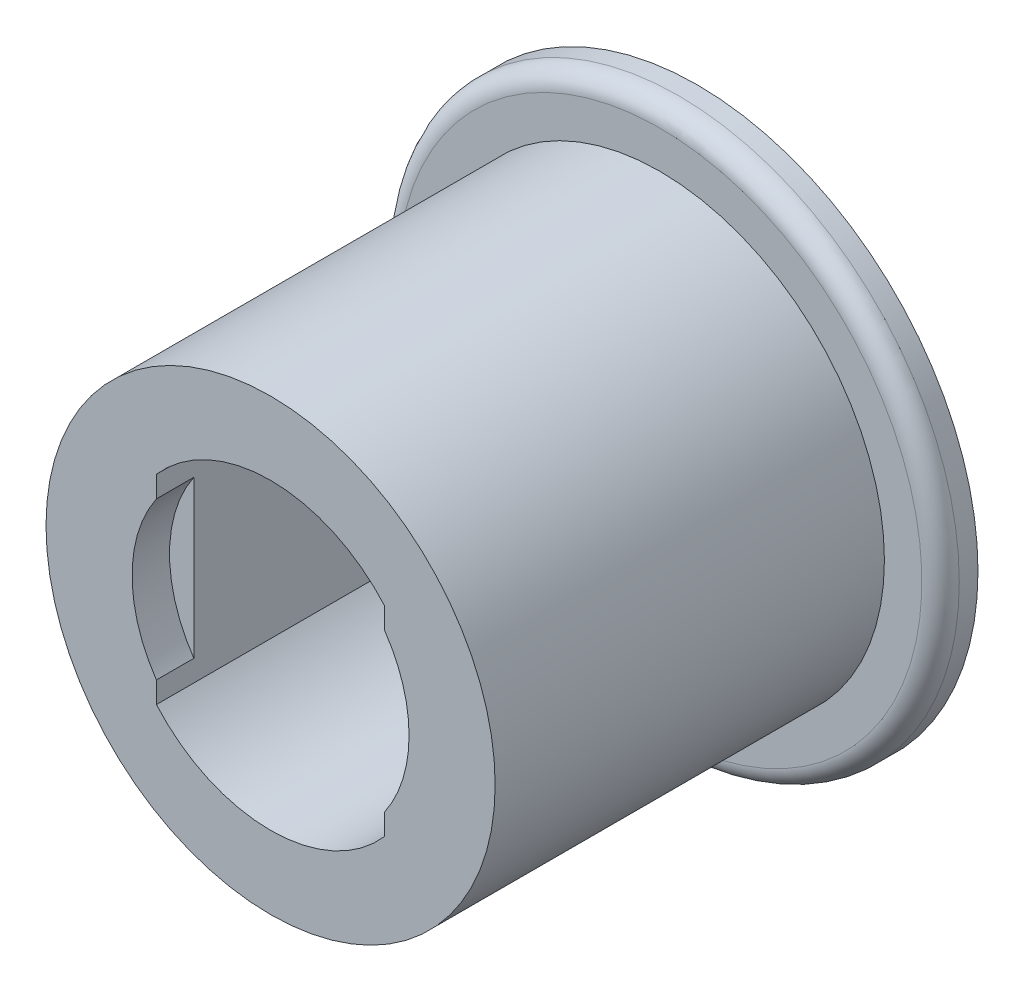
ISO-10303-21;
HEADER;
FILE_DESCRIPTION(('STEP AP214'),'2;1');
FILE_NAME('part.step','',(''),(''),'','','');
FILE_SCHEMA(('AUTOMOTIVE_DESIGN { 1 0 10303 214 1 1 1 1 }'));
ENDSEC;
DATA;
#1=APPLICATION_CONTEXT('core data for automotive mechanical design processes');
#2=APPLICATION_PROTOCOL_DEFINITION('international standard','automotive_design',2000,#1);
#3=PRODUCT_CONTEXT('',#1,'mechanical');
#4=PRODUCT('Part','Part','',(#3));
#5=PRODUCT_RELATED_PRODUCT_CATEGORY('part','',(#4));
#6=PRODUCT_DEFINITION_FORMATION('','',#4);
#7=PRODUCT_DEFINITION_CONTEXT('part definition',#1,'design');
#8=PRODUCT_DEFINITION('design','',#6,#7);
#9=PRODUCT_DEFINITION_SHAPE('','',#8);
#10=(LENGTH_UNIT() NAMED_UNIT(*) SI_UNIT(.MILLI.,.METRE.));
#11=(NAMED_UNIT(*) PLANE_ANGLE_UNIT() SI_UNIT($,.RADIAN.));
#12=(NAMED_UNIT(*) SI_UNIT($,.STERADIAN.) SOLID_ANGLE_UNIT());
#13=UNCERTAINTY_MEASURE_WITH_UNIT(LENGTH_MEASURE(1.E-05),#10,'distance_accuracy_value','');
#14=(GEOMETRIC_REPRESENTATION_CONTEXT(3) GLOBAL_UNCERTAINTY_ASSIGNED_CONTEXT((#13)) GLOBAL_UNIT_ASSIGNED_CONTEXT((#10,
#11,#12)) REPRESENTATION_CONTEXT('',''));
#15=CARTESIAN_POINT('',(0.,0.,0.));
#16=DIRECTION('',(0.,0.,1.));
#17=DIRECTION('',(1.,0.,0.));
#18=AXIS2_PLACEMENT_3D('',#15,#16,#17);
#19=CARTESIAN_POINT('',(0.,0.,0.5));
#20=DIRECTION('',(0.,0.,-1.));
#21=DIRECTION('',(-1.,0.,0.));
#22=AXIS2_PLACEMENT_3D('',#19,#20,#21);
#23=CYLINDRICAL_SURFACE('',#22,1.85);
#24=CARTESIAN_POINT('',(0.,0.,0.));
#25=DIRECTION('',(0.,0.,-1.));
#26=DIRECTION('',(-1.,0.,0.));
#27=AXIS2_PLACEMENT_3D('',#24,#25,#26);
#28=CIRCLE('',#27,1.85);
#29=CARTESIAN_POINT('',(-1.525,-1.04731800328267,0.));
#30=VERTEX_POINT('',#29);
#31=CARTESIAN_POINT('',(-1.525,1.04731800328267,0.));
#32=VERTEX_POINT('',#31);
#33=EDGE_CURVE('E181',#30,#32,#28,.T.);
#34=ORIENTED_EDGE('',*,*,#33,.T.);
#35=DIRECTION('',(0.,0.,-1.));
#36=VECTOR('',#35,1.);
#37=CARTESIAN_POINT('',(-1.525,1.04731800328267,0.5));
#38=LINE('',#37,#36);
#39=CARTESIAN_POINT('',(-1.525,1.04731800328267,0.5));
#40=VERTEX_POINT('',#39);
#41=EDGE_CURVE('E178',#32,#40,#38,.F.);
#42=ORIENTED_EDGE('',*,*,#41,.T.);
#43=CARTESIAN_POINT('',(0.,0.,0.5));
#44=DIRECTION('',(0.,0.,-1.));
#45=DIRECTION('',(-1.,0.,0.));
#46=AXIS2_PLACEMENT_3D('',#43,#44,#45);
#47=CIRCLE('',#46,1.85);
#48=CARTESIAN_POINT('',(-1.525,-1.04731800328267,0.5));
#49=VERTEX_POINT('',#48);
#50=EDGE_CURVE('E186',#49,#40,#47,.T.);
#51=ORIENTED_EDGE('',*,*,#50,.F.);
#52=DIRECTION('',(0.,0.,-1.));
#53=VECTOR('',#52,1.);
#54=CARTESIAN_POINT('',(-1.525,-1.04731800328267,0.5));
#55=LINE('',#54,#53);
#56=EDGE_CURVE('E175',#49,#30,#55,.T.);
#57=ORIENTED_EDGE('',*,*,#56,.T.);
#58=EDGE_LOOP('',(#34,#42,#51,#57));
#59=FACE_BOUND('',#58,.T.);
#60=ADVANCED_FACE('F42',(#59),#23,.F.);
#61=CARTESIAN_POINT('',(0.,0.,0.));
#62=DIRECTION('',(0.,0.,1.));
#63=DIRECTION('',(1.,0.,0.));
#64=AXIS2_PLACEMENT_3D('',#61,#62,#63);
#65=PLANE('',#64);
#66=DIRECTION('',(0.,-1.,0.));
#67=VECTOR('',#66,1.);
#68=CARTESIAN_POINT('',(-1.525,0.,0.));
#69=LINE('',#68,#67);
#70=EDGE_CURVE('E11',#32,#30,#69,.T.);
#71=ORIENTED_EDGE('',*,*,#70,.F.);
#72=ORIENTED_EDGE('',*,*,#33,.F.);
#73=EDGE_LOOP('',(#71,#72));
#74=FACE_BOUND('',#73,.T.);
#75=ADVANCED_FACE('F214',(#74),#65,.T.);
#76=CARTESIAN_POINT('',(0.,0.,0.5));
#77=DIRECTION('',(0.,0.,1.));
#78=DIRECTION('',(1.,0.,0.));
#79=AXIS2_PLACEMENT_3D('',#76,#77,#78);
#80=PLANE('',#79);
#81=DIRECTION('',(0.,1.,0.));
#82=VECTOR('',#81,1.);
#83=CARTESIAN_POINT('',(-1.525,-1.33229125944742,0.5));
#84=LINE('',#83,#82);
#85=CARTESIAN_POINT('',(-1.525,-1.33229125944742,0.5));
#86=VERTEX_POINT('',#85);
#87=EDGE_CURVE('E137',#86,#49,#84,.T.);
#88=ORIENTED_EDGE('',*,*,#87,.T.);
#89=ORIENTED_EDGE('',*,*,#50,.T.);
#90=CARTESIAN_POINT('',(-1.525,1.33229125944742,0.5));
#91=VERTEX_POINT('',#90);
#92=EDGE_CURVE('E152',#40,#91,#84,.T.);
#93=ORIENTED_EDGE('',*,*,#92,.T.);
#94=CARTESIAN_POINT('',(0.,0.,0.5));
#95=DIRECTION('',(0.,0.,-1.));
#96=DIRECTION('',(-1.,0.,0.));
#97=AXIS2_PLACEMENT_3D('',#94,#95,#96);
#98=CIRCLE('',#97,2.025);
#99=CARTESIAN_POINT('',(1.525,1.33229125944742,0.5));
#100=VERTEX_POINT('',#99);
#101=EDGE_CURVE('E132',#91,#100,#98,.T.);
#102=ORIENTED_EDGE('',*,*,#101,.T.);
#103=DIRECTION('',(0.,-1.,0.));
#104=VECTOR('',#103,1.);
#105=CARTESIAN_POINT('',(1.525,1.33229125944742,0.5));
#106=LINE('',#105,#104);
#107=CARTESIAN_POINT('',(1.525,1.04731800328267,0.5));
#108=VERTEX_POINT('',#107);
#109=EDGE_CURVE('E140',#100,#108,#106,.T.);
#110=ORIENTED_EDGE('',*,*,#109,.T.);
#111=CARTESIAN_POINT('',(1.85,0.,0.5));
#112=VERTEX_POINT('',#111);
#113=EDGE_CURVE('E187',#108,#112,#47,.T.);
#114=ORIENTED_EDGE('',*,*,#113,.T.);
#115=CARTESIAN_POINT('',(1.525,-1.04731800328267,0.5));
#116=VERTEX_POINT('',#115);
#117=EDGE_CURVE('E182',#112,#116,#47,.T.);
#118=ORIENTED_EDGE('',*,*,#117,.T.);
#119=CARTESIAN_POINT('',(1.525,-1.33229125944742,0.5));
#120=VERTEX_POINT('',#119);
#121=EDGE_CURVE('E147',#116,#120,#106,.T.);
#122=ORIENTED_EDGE('',*,*,#121,.T.);
#123=CARTESIAN_POINT('',(0.,0.,0.5));
#124=DIRECTION('',(0.,0.,-1.));
#125=DIRECTION('',(-1.,0.,0.));
#126=AXIS2_PLACEMENT_3D('',#123,#124,#125);
#127=CIRCLE('',#126,2.025);
#128=EDGE_CURVE('E146',#120,#86,#127,.T.);
#129=ORIENTED_EDGE('',*,*,#128,.T.);
#130=EDGE_LOOP('',(#88,#89,#93,#102,#110,#114,#118,#122,#129));
#131=FACE_BOUND('',#130,.T.);
#132=CARTESIAN_POINT('',(0.,0.,0.5));
#133=DIRECTION('',(0.,0.,1.));
#134=DIRECTION('',(-1.,0.,0.));
#135=AXIS2_PLACEMENT_3D('',#132,#133,#134);
#136=CIRCLE('',#135,3.);
#137=CARTESIAN_POINT('',(3.,0.,0.5));
#138=VERTEX_POINT('',#137);
#139=EDGE_CURVE('E185',#138,#138,#136,.T.);
#140=ORIENTED_EDGE('',*,*,#139,.T.);
#141=EDGE_LOOP('',(#140));
#142=FACE_BOUND('',#141,.T.);
#143=ADVANCED_FACE('F44',(#131,#142),#80,.T.);
#144=CARTESIAN_POINT('',(0.,0.,0.));
#145=DIRECTION('',(0.,0.,1.));
#146=DIRECTION('',(-1.,0.,0.));
#147=AXIS2_PLACEMENT_3D('',#144,#145,#146);
#148=CYLINDRICAL_SURFACE('',#147,3.);
#149=ORIENTED_EDGE('',*,*,#139,.F.);
#150=EDGE_LOOP('',(#149));
#151=FACE_BOUND('',#150,.T.);
#152=CARTESIAN_POINT('',(0.,0.,-4.7));
#153=DIRECTION('',(0.,0.,-1.));
#154=DIRECTION('',(1.,0.,0.));
#155=AXIS2_PLACEMENT_3D('',#152,#153,#154);
#156=CIRCLE('',#155,3.);
#157=CARTESIAN_POINT('',(-3.,0.,-4.7));
#158=VERTEX_POINT('',#157);
#159=EDGE_CURVE('E195',#158,#158,#156,.T.);
#160=ORIENTED_EDGE('',*,*,#159,.F.);
#161=EDGE_LOOP('',(#160));
#162=FACE_BOUND('',#161,.T.);
#163=ADVANCED_FACE('F236',(#151,#162),#148,.T.);
#164=CARTESIAN_POINT('',(1.525,1.04731800328267,0.));
#165=VERTEX_POINT('',#164);
#166=CARTESIAN_POINT('',(1.525,-1.04731800328267,0.));
#167=VERTEX_POINT('',#166);
#168=EDGE_CURVE('E191',#165,#167,#28,.T.);
#169=ORIENTED_EDGE('',*,*,#168,.T.);
#170=DIRECTION('',(0.,0.,-1.));
#171=VECTOR('',#170,1.);
#172=CARTESIAN_POINT('',(1.525,-1.04731800328267,0.5));
#173=LINE('',#172,#171);
#174=EDGE_CURVE('E65',#167,#116,#173,.F.);
#175=ORIENTED_EDGE('',*,*,#174,.T.);
#176=ORIENTED_EDGE('',*,*,#117,.F.);
#177=ORIENTED_EDGE('',*,*,#113,.F.);
#178=DIRECTION('',(0.,0.,-1.));
#179=VECTOR('',#178,1.);
#180=CARTESIAN_POINT('',(1.525,1.04731800328267,0.5));
#181=LINE('',#180,#179);
#182=EDGE_CURVE('E143',#108,#165,#181,.T.);
#183=ORIENTED_EDGE('',*,*,#182,.T.);
#184=EDGE_LOOP('',(#169,#175,#176,#177,#183));
#185=FACE_BOUND('',#184,.T.);
#186=ADVANCED_FACE('F207',(#185),#23,.F.);
#187=CARTESIAN_POINT('',(0.,0.,-4.2));
#188=DIRECTION('',(0.,0.,1.));
#189=DIRECTION('',(1.,0.,0.));
#190=AXIS2_PLACEMENT_3D('',#187,#188,#189);
#191=PLANE('',#190);
#192=DIRECTION('',(0.,-1.,0.));
#193=VECTOR('',#192,1.);
#194=CARTESIAN_POINT('',(1.525,1.33229125944742,-4.2));
#195=LINE('',#194,#193);
#196=CARTESIAN_POINT('',(1.525,1.33229125944742,-4.2));
#197=VERTEX_POINT('',#196);
#198=CARTESIAN_POINT('',(1.525,-1.33229125944742,-4.2));
#199=VERTEX_POINT('',#198);
#200=EDGE_CURVE('E164',#197,#199,#195,.T.);
#201=ORIENTED_EDGE('',*,*,#200,.F.);
#202=CARTESIAN_POINT('',(0.,0.,-4.2));
#203=DIRECTION('',(0.,0.,-1.));
#204=DIRECTION('',(-1.,0.,0.));
#205=AXIS2_PLACEMENT_3D('',#202,#203,#204);
#206=CIRCLE('',#205,2.025);
#207=CARTESIAN_POINT('',(-1.525,1.33229125944742,-4.2));
#208=VERTEX_POINT('',#207);
#209=EDGE_CURVE('E57',#208,#197,#206,.T.);
#210=ORIENTED_EDGE('',*,*,#209,.F.);
#211=DIRECTION('',(0.,1.,0.));
#212=VECTOR('',#211,1.);
#213=CARTESIAN_POINT('',(-1.525,-1.33229125944742,-4.2));
#214=LINE('',#213,#212);
#215=CARTESIAN_POINT('',(-1.525,-1.33229125944742,-4.2));
#216=VERTEX_POINT('',#215);
#217=EDGE_CURVE('E153',#216,#208,#214,.T.);
#218=ORIENTED_EDGE('',*,*,#217,.F.);
#219=CARTESIAN_POINT('',(0.,0.,-4.2));
#220=DIRECTION('',(0.,0.,-1.));
#221=DIRECTION('',(-1.,0.,0.));
#222=AXIS2_PLACEMENT_3D('',#219,#220,#221);
#223=CIRCLE('',#222,2.025);
#224=EDGE_CURVE('E157',#199,#216,#223,.T.);
#225=ORIENTED_EDGE('',*,*,#224,.F.);
#226=EDGE_LOOP('',(#201,#210,#218,#225));
#227=FACE_BOUND('',#226,.T.);
#228=CARTESIAN_POINT('',(0.,0.,-4.2));
#229=DIRECTION('',(0.,0.,1.));
#230=DIRECTION('',(1.,0.,0.));
#231=AXIS2_PLACEMENT_3D('',#228,#229,#230);
#232=CIRCLE('',#231,2.5);
#233=CARTESIAN_POINT('',(-2.5,0.,-4.2));
#234=VERTEX_POINT('',#233);
#235=EDGE_CURVE('E199',#234,#234,#232,.T.);
#236=ORIENTED_EDGE('',*,*,#235,.F.);
#237=EDGE_LOOP('',(#236));
#238=FACE_BOUND('',#237,.T.);
#239=ADVANCED_FACE('F235',(#227,#238),#191,.F.);
#240=CARTESIAN_POINT('',(0.,0.,-5.2));
#241=DIRECTION('',(0.,0.,1.));
#242=DIRECTION('',(1.,0.,0.));
#243=AXIS2_PLACEMENT_3D('',#240,#241,#242);
#244=PLANE('',#243);
#245=CARTESIAN_POINT('',(0.,0.,-5.2));
#246=DIRECTION('',(0.,0.,-1.));
#247=DIRECTION('',(-1.,0.,0.));
#248=AXIS2_PLACEMENT_3D('',#245,#246,#247);
#249=CIRCLE('',#248,3.72474487139159);
#250=CARTESIAN_POINT('',(3.72474487139159,0.,-5.2));
#251=VERTEX_POINT('',#250);
#252=EDGE_CURVE('E201',#251,#251,#249,.T.);
#253=ORIENTED_EDGE('',*,*,#252,.F.);
#254=EDGE_LOOP('',(#253));
#255=FACE_BOUND('',#254,.T.);
#256=CARTESIAN_POINT('',(0.,0.,-5.2));
#257=DIRECTION('',(0.,0.,-1.));
#258=DIRECTION('',(1.,0.,0.));
#259=AXIS2_PLACEMENT_3D('',#256,#257,#258);
#260=CIRCLE('',#259,3.75);
#261=CARTESIAN_POINT('',(-3.75,0.,-5.2));
#262=VERTEX_POINT('',#261);
#263=EDGE_CURVE('E197',#262,#262,#260,.T.);
#264=ORIENTED_EDGE('',*,*,#263,.T.);
#265=EDGE_LOOP('',(#264));
#266=FACE_BOUND('',#265,.T.);
#267=ADVANCED_FACE('F241',(#255,#266),#244,.F.);
#268=CARTESIAN_POINT('',(0.,0.,-3.95));
#269=DIRECTION('',(0.,0.,-1.));
#270=DIRECTION('',(-1.,0.,0.));
#271=AXIS2_PLACEMENT_3D('',#268,#269,#270);
#272=TOROIDAL_SURFACE('',#271,3.72474487139159,1.25);
#273=ORIENTED_EDGE('',*,*,#252,.T.);
#274=EDGE_LOOP('',(#273));
#275=FACE_BOUND('',#274,.T.);
#276=ORIENTED_EDGE('',*,*,#235,.T.);
#277=EDGE_LOOP('',(#276));
#278=FACE_BOUND('',#277,.T.);
#279=ADVANCED_FACE('F261',(#275,#278),#272,.T.);
#280=CARTESIAN_POINT('',(0.,0.,-4.7));
#281=DIRECTION('',(0.,0.,-1.));
#282=DIRECTION('',(1.,0.,0.));
#283=AXIS2_PLACEMENT_3D('',#280,#281,#282);
#284=CYLINDRICAL_SURFACE('',#283,3.75);
#285=CARTESIAN_POINT('',(0.,0.,-4.95));
#286=DIRECTION('',(0.,0.,1.));
#287=DIRECTION('',(1.,0.,0.));
#288=AXIS2_PLACEMENT_3D('',#285,#286,#287);
#289=CIRCLE('',#288,3.75);
#290=CARTESIAN_POINT('',(-3.75,0.,-4.95));
#291=VERTEX_POINT('',#290);
#292=EDGE_CURVE('E188',#291,#291,#289,.T.);
#293=ORIENTED_EDGE('',*,*,#292,.F.);
#294=EDGE_LOOP('',(#293));
#295=FACE_BOUND('',#294,.T.);
#296=ORIENTED_EDGE('',*,*,#263,.F.);
#297=EDGE_LOOP('',(#296));
#298=FACE_BOUND('',#297,.T.);
#299=ADVANCED_FACE('F253',(#295,#298),#284,.T.);
#300=CARTESIAN_POINT('',(0.,0.,-4.7));
#301=DIRECTION('',(0.,0.,1.));
#302=DIRECTION('',(1.,0.,0.));
#303=AXIS2_PLACEMENT_3D('',#300,#301,#302);
#304=PLANE('',#303);
#305=ORIENTED_EDGE('',*,*,#159,.T.);
#306=EDGE_LOOP('',(#305));
#307=FACE_BOUND('',#306,.T.);
#308=CARTESIAN_POINT('',(0.,0.,-4.7));
#309=DIRECTION('',(0.,0.,-1.));
#310=DIRECTION('',(1.,0.,0.));
#311=AXIS2_PLACEMENT_3D('',#308,#309,#310);
#312=CIRCLE('',#311,3.5);
#313=CARTESIAN_POINT('',(-3.5,0.,-4.7));
#314=VERTEX_POINT('',#313);
#315=EDGE_CURVE('E190',#314,#314,#312,.T.);
#316=ORIENTED_EDGE('',*,*,#315,.F.);
#317=EDGE_LOOP('',(#316));
#318=FACE_BOUND('',#317,.T.);
#319=ADVANCED_FACE('F221',(#307,#318),#304,.T.);
#320=CARTESIAN_POINT('',(0.,0.,-4.95));
#321=DIRECTION('',(0.,0.,1.));
#322=DIRECTION('',(1.,0.,0.));
#323=AXIS2_PLACEMENT_3D('',#320,#321,#322);
#324=TOROIDAL_SURFACE('',#323,3.5,0.25);
#325=ORIENTED_EDGE('',*,*,#315,.T.);
#326=EDGE_LOOP('',(#325));
#327=FACE_BOUND('',#326,.T.);
#328=ORIENTED_EDGE('',*,*,#292,.T.);
#329=EDGE_LOOP('',(#328));
#330=FACE_BOUND('',#329,.T.);
#331=ADVANCED_FACE('F212',(#327,#330),#324,.T.);
#332=DIRECTION('',(0.,1.,0.));
#333=VECTOR('',#332,1.);
#334=CARTESIAN_POINT('',(1.525,0.,0.));
#335=LINE('',#334,#333);
#336=EDGE_CURVE('E50',#167,#165,#335,.T.);
#337=ORIENTED_EDGE('',*,*,#336,.F.);
#338=ORIENTED_EDGE('',*,*,#168,.F.);
#339=EDGE_LOOP('',(#337,#338));
#340=FACE_BOUND('',#339,.T.);
#341=ADVANCED_FACE('F209',(#340),#65,.T.);
#342=CARTESIAN_POINT('',(-1.525,-1.33229125944742,0.5));
#343=DIRECTION('',(-1.,0.,0.));
#344=DIRECTION('',(0.,0.,1.));
#345=AXIS2_PLACEMENT_3D('',#342,#343,#344);
#346=PLANE('',#345);
#347=ORIENTED_EDGE('',*,*,#70,.T.);
#348=ORIENTED_EDGE('',*,*,#56,.F.);
#349=ORIENTED_EDGE('',*,*,#87,.F.);
#350=DIRECTION('',(0.,0.,-1.));
#351=VECTOR('',#350,1.);
#352=CARTESIAN_POINT('',(-1.525,-1.33229125944742,0.5));
#353=LINE('',#352,#351);
#354=EDGE_CURVE('E170',#86,#216,#353,.T.);
#355=ORIENTED_EDGE('',*,*,#354,.T.);
#356=ORIENTED_EDGE('',*,*,#217,.T.);
#357=DIRECTION('',(0.,0.,-1.));
#358=VECTOR('',#357,1.);
#359=CARTESIAN_POINT('',(-1.525,1.33229125944742,0.5));
#360=LINE('',#359,#358);
#361=EDGE_CURVE('E168',#91,#208,#360,.T.);
#362=ORIENTED_EDGE('',*,*,#361,.F.);
#363=ORIENTED_EDGE('',*,*,#92,.F.);
#364=ORIENTED_EDGE('',*,*,#41,.F.);
#365=EDGE_LOOP('',(#347,#348,#349,#355,#356,#362,#363,#364));
#366=FACE_BOUND('',#365,.T.);
#367=ADVANCED_FACE('F211',(#366),#346,.F.);
#368=CARTESIAN_POINT('',(1.525,1.33229125944742,0.5));
#369=DIRECTION('',(1.,0.,0.));
#370=DIRECTION('',(0.,0.,-1.));
#371=AXIS2_PLACEMENT_3D('',#368,#369,#370);
#372=PLANE('',#371);
#373=ORIENTED_EDGE('',*,*,#336,.T.);
#374=ORIENTED_EDGE('',*,*,#182,.F.);
#375=ORIENTED_EDGE('',*,*,#109,.F.);
#376=DIRECTION('',(0.,0.,-1.));
#377=VECTOR('',#376,1.);
#378=CARTESIAN_POINT('',(1.525,1.33229125944742,0.5));
#379=LINE('',#378,#377);
#380=EDGE_CURVE('E128',#100,#197,#379,.T.);
#381=ORIENTED_EDGE('',*,*,#380,.T.);
#382=ORIENTED_EDGE('',*,*,#200,.T.);
#383=DIRECTION('',(0.,0.,-1.));
#384=VECTOR('',#383,1.);
#385=CARTESIAN_POINT('',(1.525,-1.33229125944742,0.5));
#386=LINE('',#385,#384);
#387=EDGE_CURVE('E136',#120,#199,#386,.T.);
#388=ORIENTED_EDGE('',*,*,#387,.F.);
#389=ORIENTED_EDGE('',*,*,#121,.F.);
#390=ORIENTED_EDGE('',*,*,#174,.F.);
#391=EDGE_LOOP('',(#373,#374,#375,#381,#382,#388,#389,#390));
#392=FACE_BOUND('',#391,.T.);
#393=ADVANCED_FACE('F141',(#392),#372,.F.);
#394=CARTESIAN_POINT('',(0.,0.,0.5));
#395=DIRECTION('',(0.,0.,-1.));
#396=DIRECTION('',(-1.,0.,0.));
#397=AXIS2_PLACEMENT_3D('',#394,#395,#396);
#398=CYLINDRICAL_SURFACE('',#397,2.025);
#399=ORIENTED_EDGE('',*,*,#209,.T.);
#400=ORIENTED_EDGE('',*,*,#380,.F.);
#401=ORIENTED_EDGE('',*,*,#101,.F.);
#402=ORIENTED_EDGE('',*,*,#361,.T.);
#403=EDGE_LOOP('',(#399,#400,#401,#402));
#404=FACE_BOUND('',#403,.T.);
#405=ADVANCED_FACE('F130',(#404),#398,.F.);
#406=CARTESIAN_POINT('',(0.,0.,0.5));
#407=DIRECTION('',(0.,0.,-1.));
#408=DIRECTION('',(-1.,0.,0.));
#409=AXIS2_PLACEMENT_3D('',#406,#407,#408);
#410=CYLINDRICAL_SURFACE('',#409,2.025);
#411=ORIENTED_EDGE('',*,*,#224,.T.);
#412=ORIENTED_EDGE('',*,*,#354,.F.);
#413=ORIENTED_EDGE('',*,*,#128,.F.);
#414=ORIENTED_EDGE('',*,*,#387,.T.);
#415=EDGE_LOOP('',(#411,#412,#413,#414));
#416=FACE_BOUND('',#415,.T.);
#417=ADVANCED_FACE('F275',(#416),#410,.F.);
#418=CLOSED_SHELL('',(#60,#75,#143,#163,#186,#239,#267,#279,#299,#319,#331,#341,#367,#393,#405,#417));
#419=MANIFOLD_SOLID_BREP('B2',#418);
#420=ADVANCED_BREP_SHAPE_REPRESENTATION('',(#18,#419),#14);
#421=SHAPE_DEFINITION_REPRESENTATION(#9,#420);
ENDSEC;
END-ISO-10303-21;
